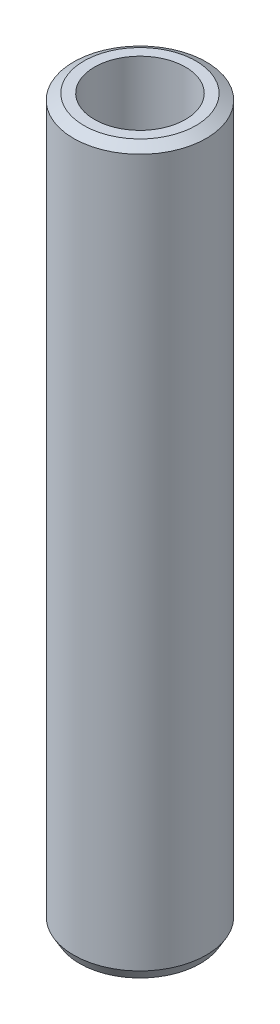
ISO-10303-21;
HEADER;
FILE_DESCRIPTION(('STEP AP214'),'2;1');
FILE_NAME('part.step','',(''),(''),'','','');
FILE_SCHEMA(('AUTOMOTIVE_DESIGN { 1 0 10303 214 1 1 1 1 }'));
ENDSEC;
DATA;
#1=APPLICATION_CONTEXT('core data for automotive mechanical design processes');
#2=APPLICATION_PROTOCOL_DEFINITION('international standard','automotive_design',2000,#1);
#3=PRODUCT_CONTEXT('',#1,'mechanical');
#4=PRODUCT('Part','Part','',(#3));
#5=PRODUCT_RELATED_PRODUCT_CATEGORY('part','',(#4));
#6=PRODUCT_DEFINITION_FORMATION('','',#4);
#7=PRODUCT_DEFINITION_CONTEXT('part definition',#1,'design');
#8=PRODUCT_DEFINITION('design','',#6,#7);
#9=PRODUCT_DEFINITION_SHAPE('','',#8);
#10=(LENGTH_UNIT() NAMED_UNIT(*) SI_UNIT(.MILLI.,.METRE.));
#11=(NAMED_UNIT(*) PLANE_ANGLE_UNIT() SI_UNIT($,.RADIAN.));
#12=(NAMED_UNIT(*) SI_UNIT($,.STERADIAN.) SOLID_ANGLE_UNIT());
#13=UNCERTAINTY_MEASURE_WITH_UNIT(LENGTH_MEASURE(1.E-05),#10,'distance_accuracy_value','');
#14=(GEOMETRIC_REPRESENTATION_CONTEXT(3) GLOBAL_UNCERTAINTY_ASSIGNED_CONTEXT((#13)) GLOBAL_UNIT_ASSIGNED_CONTEXT((#10,
#11,#12)) REPRESENTATION_CONTEXT('',''));
#15=CARTESIAN_POINT('',(0.,0.,0.));
#16=DIRECTION('',(0.,0.,1.));
#17=DIRECTION('',(1.,0.,0.));
#18=AXIS2_PLACEMENT_3D('',#15,#16,#17);
#19=CARTESIAN_POINT('',(0.,600.,0.));
#20=DIRECTION('',(0.,-1.,0.));
#21=DIRECTION('',(0.,0.,-1.));
#22=AXIS2_PLACEMENT_3D('',#19,#20,#21);
#23=CYLINDRICAL_SURFACE('',#22,55.);
#24=CARTESIAN_POINT('',(0.,595.053971391219,0.));
#25=DIRECTION('',(0.,1.,0.));
#26=DIRECTION('',(0.,0.,1.));
#27=AXIS2_PLACEMENT_3D('',#24,#25,#26);
#28=CIRCLE('',#27,55.);
#29=CARTESIAN_POINT('',(0.,595.053971391219,55.));
#30=VERTEX_POINT('',#29);
#31=EDGE_CURVE('E50',#30,#30,#28,.F.);
#32=ORIENTED_EDGE('',*,*,#31,.T.);
#33=EDGE_LOOP('',(#32));
#34=FACE_BOUND('',#33,.T.);
#35=CARTESIAN_POINT('',(0.,8.56677284609764,0.));
#36=DIRECTION('',(0.,1.,0.));
#37=DIRECTION('',(0.,0.,1.));
#38=AXIS2_PLACEMENT_3D('',#35,#36,#37);
#39=CIRCLE('',#38,55.);
#40=CARTESIAN_POINT('',(0.,8.56677284609764,55.));
#41=VERTEX_POINT('',#40);
#42=EDGE_CURVE('E51',#41,#41,#39,.T.);
#43=ORIENTED_EDGE('',*,*,#42,.T.);
#44=EDGE_LOOP('',(#43));
#45=FACE_BOUND('',#44,.T.);
#46=ADVANCED_FACE('F39',(#34,#45),#23,.T.);
#47=CARTESIAN_POINT('',(0.,600.,0.));
#48=DIRECTION('',(0.,1.,0.));
#49=DIRECTION('',(0.,0.,1.));
#50=AXIS2_PLACEMENT_3D('',#47,#48,#49);
#51=PLANE('',#50);
#52=CARTESIAN_POINT('',(0.,600.,0.));
#53=DIRECTION('',(0.,1.,0.));
#54=DIRECTION('',(0.,0.,1.));
#55=AXIS2_PLACEMENT_3D('',#52,#53,#54);
#56=CIRCLE('',#55,46.4332271539017);
#57=CARTESIAN_POINT('',(0.,600.,46.4332271539017));
#58=VERTEX_POINT('',#57);
#59=EDGE_CURVE('E54',#58,#58,#56,.T.);
#60=ORIENTED_EDGE('',*,*,#59,.T.);
#61=EDGE_LOOP('',(#60));
#62=FACE_BOUND('',#61,.T.);
#63=CARTESIAN_POINT('',(0.,600.,0.));
#64=DIRECTION('',(0.,1.,0.));
#65=DIRECTION('',(0.,0.,1.));
#66=AXIS2_PLACEMENT_3D('',#63,#64,#65);
#67=CIRCLE('',#66,37.7120281900324);
#68=CARTESIAN_POINT('',(0.,600.,37.7120281900324));
#69=VERTEX_POINT('',#68);
#70=EDGE_CURVE('E58',#69,#69,#67,.T.);
#71=ORIENTED_EDGE('',*,*,#70,.F.);
#72=EDGE_LOOP('',(#71));
#73=FACE_BOUND('',#72,.T.);
#74=ADVANCED_FACE('F69',(#62,#73),#51,.T.);
#75=CARTESIAN_POINT('',(0.,0.,0.));
#76=DIRECTION('',(0.,1.,0.));
#77=DIRECTION('',(0.,0.,1.));
#78=AXIS2_PLACEMENT_3D('',#75,#76,#77);
#79=PLANE('',#78);
#80=CARTESIAN_POINT('',(0.,0.,0.));
#81=DIRECTION('',(0.,1.,0.));
#82=DIRECTION('',(0.,0.,1.));
#83=AXIS2_PLACEMENT_3D('',#80,#81,#82);
#84=CIRCLE('',#83,50.0539713912191);
#85=CARTESIAN_POINT('',(0.,0.,50.0539713912191));
#86=VERTEX_POINT('',#85);
#87=EDGE_CURVE('E10',#86,#86,#84,.F.);
#88=ORIENTED_EDGE('',*,*,#87,.T.);
#89=EDGE_LOOP('',(#88));
#90=FACE_BOUND('',#89,.T.);
#91=CARTESIAN_POINT('',(0.,0.,0.));
#92=DIRECTION('',(0.,1.,0.));
#93=DIRECTION('',(0.,0.,1.));
#94=AXIS2_PLACEMENT_3D('',#91,#92,#93);
#95=CIRCLE('',#94,37.7120281900324);
#96=CARTESIAN_POINT('',(0.,0.,37.7120281900324));
#97=VERTEX_POINT('',#96);
#98=EDGE_CURVE('E63',#97,#97,#95,.T.);
#99=ORIENTED_EDGE('',*,*,#98,.T.);
#100=EDGE_LOOP('',(#99));
#101=FACE_BOUND('',#100,.T.);
#102=ADVANCED_FACE('F75',(#90,#101),#79,.F.);
#103=CARTESIAN_POINT('',(0.,600.,0.));
#104=DIRECTION('',(0.,-1.,0.));
#105=DIRECTION('',(0.,0.,-1.));
#106=AXIS2_PLACEMENT_3D('',#103,#104,#105);
#107=CYLINDRICAL_SURFACE('',#106,37.7120281900324);
#108=ORIENTED_EDGE('',*,*,#70,.T.);
#109=EDGE_LOOP('',(#108));
#110=FACE_BOUND('',#109,.T.);
#111=ORIENTED_EDGE('',*,*,#98,.F.);
#112=EDGE_LOOP('',(#111));
#113=FACE_BOUND('',#112,.T.);
#114=ADVANCED_FACE('F70',(#110,#113),#107,.F.);
#115=CARTESIAN_POINT('',(0.,600.,0.));
#116=DIRECTION('',(0.,-1.,0.));
#117=DIRECTION('',(0.,0.,-1.));
#118=AXIS2_PLACEMENT_3D('',#115,#116,#117);
#119=CONICAL_SURFACE('',#118,46.4332271539017,1.04719755119659);
#120=ORIENTED_EDGE('',*,*,#31,.F.);
#121=EDGE_LOOP('',(#120));
#122=FACE_BOUND('',#121,.T.);
#123=ORIENTED_EDGE('',*,*,#59,.F.);
#124=EDGE_LOOP('',(#123));
#125=FACE_BOUND('',#124,.T.);
#126=ADVANCED_FACE('F81',(#122,#125),#119,.T.);
#127=CARTESIAN_POINT('',(0.,8.56677284609764,0.));
#128=DIRECTION('',(0.,1.,0.));
#129=DIRECTION('',(0.,0.,1.));
#130=AXIS2_PLACEMENT_3D('',#127,#128,#129);
#131=CONICAL_SURFACE('',#130,55.,0.523598775598305);
#132=ORIENTED_EDGE('',*,*,#87,.F.);
#133=EDGE_LOOP('',(#132));
#134=FACE_BOUND('',#133,.T.);
#135=ORIENTED_EDGE('',*,*,#42,.F.);
#136=EDGE_LOOP('',(#135));
#137=FACE_BOUND('',#136,.T.);
#138=ADVANCED_FACE('F45',(#134,#137),#131,.T.);
#139=CLOSED_SHELL('',(#46,#74,#102,#114,#126,#138));
#140=MANIFOLD_SOLID_BREP('B2',#139);
#141=ADVANCED_BREP_SHAPE_REPRESENTATION('',(#18,#140),#14);
#142=SHAPE_DEFINITION_REPRESENTATION(#9,#141);
ENDSEC;
END-ISO-10303-21;
